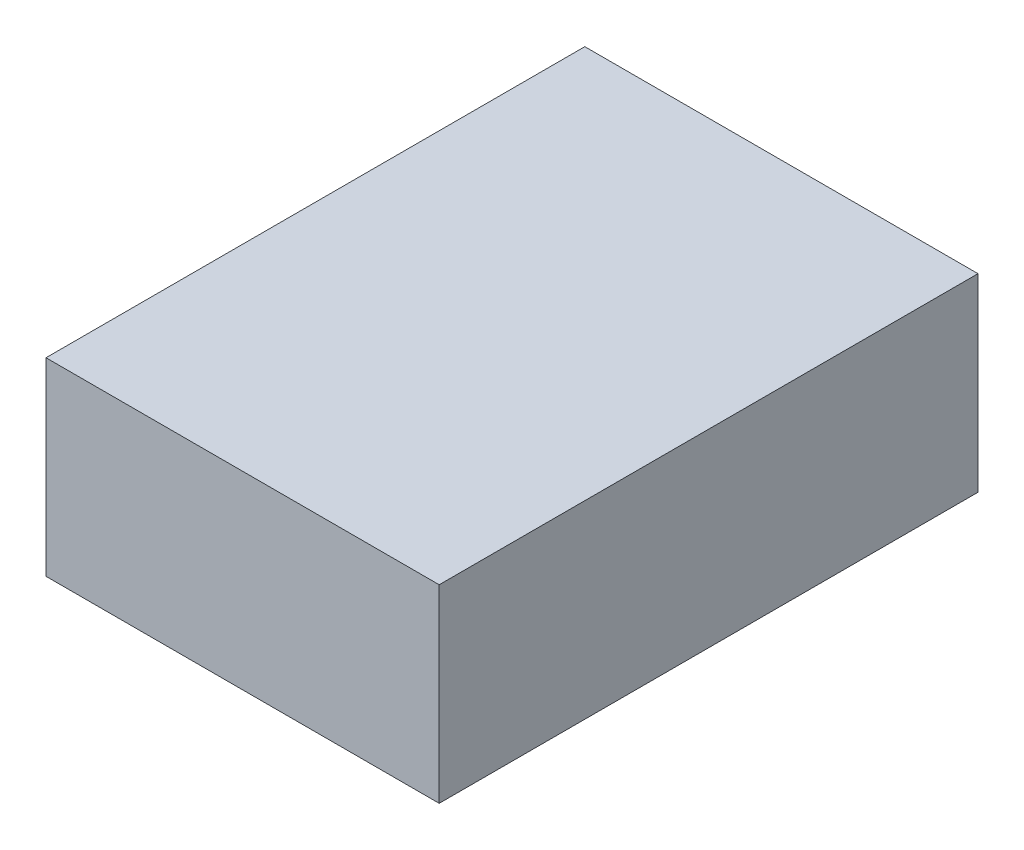
ISO-10303-21;
HEADER;
FILE_DESCRIPTION(('STEP AP214'),'2;1');
FILE_NAME('part.step','',(''),(''),'','','');
FILE_SCHEMA(('AUTOMOTIVE_DESIGN { 1 0 10303 214 1 1 1 1 }'));
ENDSEC;
DATA;
#1=APPLICATION_CONTEXT('core data for automotive mechanical design processes');
#2=APPLICATION_PROTOCOL_DEFINITION('international standard','automotive_design',2000,#1);
#3=PRODUCT_CONTEXT('',#1,'mechanical');
#4=PRODUCT('Part','Part','',(#3));
#5=PRODUCT_RELATED_PRODUCT_CATEGORY('part','',(#4));
#6=PRODUCT_DEFINITION_FORMATION('','',#4);
#7=PRODUCT_DEFINITION_CONTEXT('part definition',#1,'design');
#8=PRODUCT_DEFINITION('design','',#6,#7);
#9=PRODUCT_DEFINITION_SHAPE('','',#8);
#10=(LENGTH_UNIT() NAMED_UNIT(*) SI_UNIT(.MILLI.,.METRE.));
#11=(NAMED_UNIT(*) PLANE_ANGLE_UNIT() SI_UNIT($,.RADIAN.));
#12=(NAMED_UNIT(*) SI_UNIT($,.STERADIAN.) SOLID_ANGLE_UNIT());
#13=UNCERTAINTY_MEASURE_WITH_UNIT(LENGTH_MEASURE(1.E-05),#10,'distance_accuracy_value','');
#14=(GEOMETRIC_REPRESENTATION_CONTEXT(3) GLOBAL_UNCERTAINTY_ASSIGNED_CONTEXT((#13)) GLOBAL_UNIT_ASSIGNED_CONTEXT((#10,
#11,#12)) REPRESENTATION_CONTEXT('',''));
#15=CARTESIAN_POINT('',(0.,0.,0.));
#16=DIRECTION('',(0.,0.,1.));
#17=DIRECTION('',(1.,0.,0.));
#18=AXIS2_PLACEMENT_3D('',#15,#16,#17);
#19=CARTESIAN_POINT('',(-13.5,13.,-18.5));
#20=DIRECTION('',(1.,0.,0.));
#21=DIRECTION('',(0.,0.,-1.));
#22=AXIS2_PLACEMENT_3D('',#19,#20,#21);
#23=PLANE('',#22);
#24=DIRECTION('',(0.,0.,1.));
#25=VECTOR('',#24,1.);
#26=CARTESIAN_POINT('',(-13.5,0.,-18.5));
#27=LINE('',#26,#25);
#28=CARTESIAN_POINT('',(-13.5,0.,-18.5));
#29=VERTEX_POINT('',#28);
#30=CARTESIAN_POINT('',(-13.5,0.,18.5));
#31=VERTEX_POINT('',#30);
#32=EDGE_CURVE('E98',#29,#31,#27,.T.);
#33=ORIENTED_EDGE('',*,*,#32,.T.);
#34=DIRECTION('',(0.,-1.,0.));
#35=VECTOR('',#34,1.);
#36=CARTESIAN_POINT('',(-13.5,13.,18.5));
#37=LINE('',#36,#35);
#38=CARTESIAN_POINT('',(-13.5,13.,18.5));
#39=VERTEX_POINT('',#38);
#40=EDGE_CURVE('E11',#39,#31,#37,.T.);
#41=ORIENTED_EDGE('',*,*,#40,.F.);
#42=DIRECTION('',(0.,0.,1.));
#43=VECTOR('',#42,1.);
#44=CARTESIAN_POINT('',(-13.5,13.,-18.5));
#45=LINE('',#44,#43);
#46=CARTESIAN_POINT('',(-13.5,13.,-18.5));
#47=VERTEX_POINT('',#46);
#48=EDGE_CURVE('E86',#47,#39,#45,.T.);
#49=ORIENTED_EDGE('',*,*,#48,.F.);
#50=DIRECTION('',(0.,-1.,0.));
#51=VECTOR('',#50,1.);
#52=CARTESIAN_POINT('',(-13.5,13.,-18.5));
#53=LINE('',#52,#51);
#54=EDGE_CURVE('E94',#47,#29,#53,.T.);
#55=ORIENTED_EDGE('',*,*,#54,.T.);
#56=EDGE_LOOP('',(#33,#41,#49,#55));
#57=FACE_BOUND('',#56,.T.);
#58=ADVANCED_FACE('F35',(#57),#23,.F.);
#59=CARTESIAN_POINT('',(-13.5,13.,18.5));
#60=DIRECTION('',(0.,0.,-1.));
#61=DIRECTION('',(-1.,0.,0.));
#62=AXIS2_PLACEMENT_3D('',#59,#60,#61);
#63=PLANE('',#62);
#64=DIRECTION('',(1.,0.,0.));
#65=VECTOR('',#64,1.);
#66=CARTESIAN_POINT('',(-13.5,0.,18.5));
#67=LINE('',#66,#65);
#68=CARTESIAN_POINT('',(13.5,0.,18.5));
#69=VERTEX_POINT('',#68);
#70=EDGE_CURVE('E90',#31,#69,#67,.T.);
#71=ORIENTED_EDGE('',*,*,#70,.T.);
#72=DIRECTION('',(0.,-1.,0.));
#73=VECTOR('',#72,1.);
#74=CARTESIAN_POINT('',(13.5,13.,18.5));
#75=LINE('',#74,#73);
#76=CARTESIAN_POINT('',(13.5,13.,18.5));
#77=VERTEX_POINT('',#76);
#78=EDGE_CURVE('E43',#77,#69,#75,.T.);
#79=ORIENTED_EDGE('',*,*,#78,.F.);
#80=DIRECTION('',(1.,0.,0.));
#81=VECTOR('',#80,1.);
#82=CARTESIAN_POINT('',(-13.5,13.,18.5));
#83=LINE('',#82,#81);
#84=EDGE_CURVE('E81',#39,#77,#83,.T.);
#85=ORIENTED_EDGE('',*,*,#84,.F.);
#86=ORIENTED_EDGE('',*,*,#40,.T.);
#87=EDGE_LOOP('',(#71,#79,#85,#86));
#88=FACE_BOUND('',#87,.T.);
#89=ADVANCED_FACE('F89',(#88),#63,.F.);
#90=CARTESIAN_POINT('',(13.5,13.,-18.5));
#91=DIRECTION('',(-1.,0.,0.));
#92=DIRECTION('',(0.,0.,1.));
#93=AXIS2_PLACEMENT_3D('',#90,#91,#92);
#94=PLANE('',#93);
#95=DIRECTION('',(0.,0.,-1.));
#96=VECTOR('',#95,1.);
#97=CARTESIAN_POINT('',(13.5,0.,-18.5));
#98=LINE('',#97,#96);
#99=CARTESIAN_POINT('',(13.5,0.,-18.5));
#100=VERTEX_POINT('',#99);
#101=EDGE_CURVE('E68',#69,#100,#98,.T.);
#102=ORIENTED_EDGE('',*,*,#101,.T.);
#103=DIRECTION('',(0.,-1.,0.));
#104=VECTOR('',#103,1.);
#105=CARTESIAN_POINT('',(13.5,13.,-18.5));
#106=LINE('',#105,#104);
#107=CARTESIAN_POINT('',(13.5,13.,-18.5));
#108=VERTEX_POINT('',#107);
#109=EDGE_CURVE('E91',#108,#100,#106,.T.);
#110=ORIENTED_EDGE('',*,*,#109,.F.);
#111=DIRECTION('',(0.,0.,-1.));
#112=VECTOR('',#111,1.);
#113=CARTESIAN_POINT('',(13.5,13.,-18.5));
#114=LINE('',#113,#112);
#115=EDGE_CURVE('E84',#77,#108,#114,.T.);
#116=ORIENTED_EDGE('',*,*,#115,.F.);
#117=ORIENTED_EDGE('',*,*,#78,.T.);
#118=EDGE_LOOP('',(#102,#110,#116,#117));
#119=FACE_BOUND('',#118,.T.);
#120=ADVANCED_FACE('F92',(#119),#94,.F.);
#121=CARTESIAN_POINT('',(-13.5,13.,-18.5));
#122=DIRECTION('',(0.,0.,1.));
#123=DIRECTION('',(1.,0.,0.));
#124=AXIS2_PLACEMENT_3D('',#121,#122,#123);
#125=PLANE('',#124);
#126=DIRECTION('',(-1.,0.,0.));
#127=VECTOR('',#126,1.);
#128=CARTESIAN_POINT('',(-13.5,0.,-18.5));
#129=LINE('',#128,#127);
#130=EDGE_CURVE('E74',#100,#29,#129,.T.);
#131=ORIENTED_EDGE('',*,*,#130,.T.);
#132=ORIENTED_EDGE('',*,*,#54,.F.);
#133=DIRECTION('',(-1.,0.,0.));
#134=VECTOR('',#133,1.);
#135=CARTESIAN_POINT('',(-13.5,13.,-18.5));
#136=LINE('',#135,#134);
#137=EDGE_CURVE('E51',#108,#47,#136,.T.);
#138=ORIENTED_EDGE('',*,*,#137,.F.);
#139=ORIENTED_EDGE('',*,*,#109,.T.);
#140=EDGE_LOOP('',(#131,#132,#138,#139));
#141=FACE_BOUND('',#140,.T.);
#142=ADVANCED_FACE('F105',(#141),#125,.F.);
#143=CARTESIAN_POINT('',(0.,13.,0.));
#144=DIRECTION('',(0.,1.,0.));
#145=DIRECTION('',(0.,0.,1.));
#146=AXIS2_PLACEMENT_3D('',#143,#144,#145);
#147=PLANE('',#146);
#148=ORIENTED_EDGE('',*,*,#48,.T.);
#149=ORIENTED_EDGE('',*,*,#84,.T.);
#150=ORIENTED_EDGE('',*,*,#115,.T.);
#151=ORIENTED_EDGE('',*,*,#137,.T.);
#152=EDGE_LOOP('',(#148,#149,#150,#151));
#153=FACE_BOUND('',#152,.T.);
#154=ADVANCED_FACE('F82',(#153),#147,.T.);
#155=CARTESIAN_POINT('',(0.,0.,0.));
#156=DIRECTION('',(0.,1.,0.));
#157=DIRECTION('',(0.,0.,1.));
#158=AXIS2_PLACEMENT_3D('',#155,#156,#157);
#159=PLANE('',#158);
#160=ORIENTED_EDGE('',*,*,#32,.F.);
#161=ORIENTED_EDGE('',*,*,#130,.F.);
#162=ORIENTED_EDGE('',*,*,#101,.F.);
#163=ORIENTED_EDGE('',*,*,#70,.F.);
#164=EDGE_LOOP('',(#160,#161,#162,#163));
#165=FACE_BOUND('',#164,.T.);
#166=ADVANCED_FACE('F108',(#165),#159,.F.);
#167=CLOSED_SHELL('',(#58,#89,#120,#142,#154,#166));
#168=MANIFOLD_SOLID_BREP('B2',#167);
#169=ADVANCED_BREP_SHAPE_REPRESENTATION('',(#18,#168),#14);
#170=SHAPE_DEFINITION_REPRESENTATION(#9,#169);
ENDSEC;
END-ISO-10303-21;
